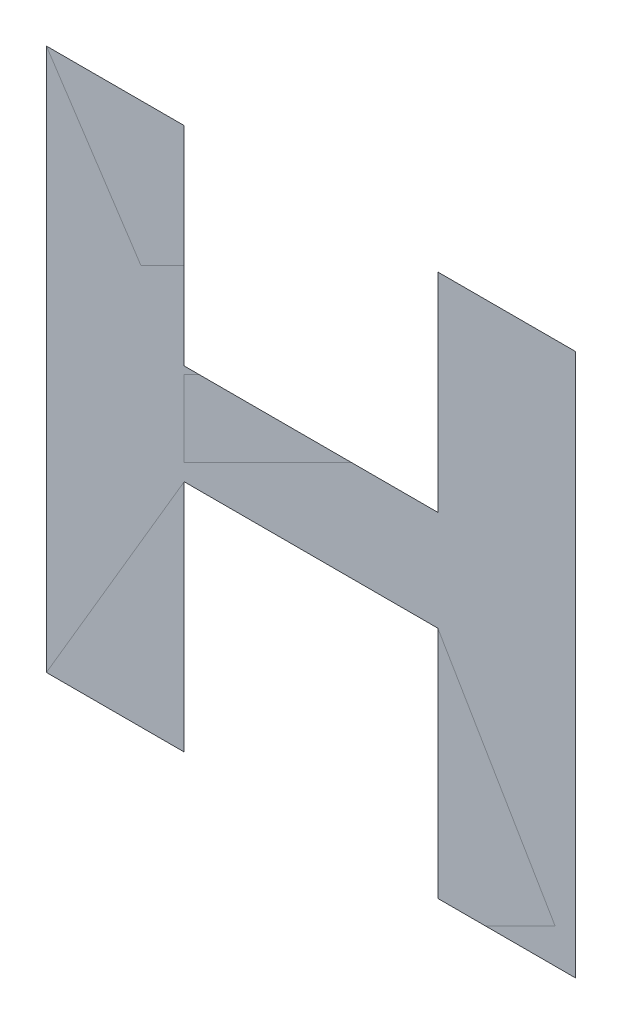
ISO-10303-21;
HEADER;
FILE_DESCRIPTION(('STEP AP214'),'2;1');
FILE_NAME('part.step','',(''),(''),'','','');
FILE_SCHEMA(('AUTOMOTIVE_DESIGN { 1 0 10303 214 1 1 1 1 }'));
ENDSEC;
DATA;
#1=APPLICATION_CONTEXT('core data for automotive mechanical design processes');
#2=APPLICATION_PROTOCOL_DEFINITION('international standard','automotive_design',2000,#1);
#3=PRODUCT_CONTEXT('',#1,'mechanical');
#4=PRODUCT('Part','Part','',(#3));
#5=PRODUCT_RELATED_PRODUCT_CATEGORY('part','',(#4));
#6=PRODUCT_DEFINITION_FORMATION('','',#4);
#7=PRODUCT_DEFINITION_CONTEXT('part definition',#1,'design');
#8=PRODUCT_DEFINITION('design','',#6,#7);
#9=PRODUCT_DEFINITION_SHAPE('','',#8);
#10=(LENGTH_UNIT() NAMED_UNIT(*) SI_UNIT(.MILLI.,.METRE.));
#11=(NAMED_UNIT(*) PLANE_ANGLE_UNIT() SI_UNIT($,.RADIAN.));
#12=(NAMED_UNIT(*) SI_UNIT($,.STERADIAN.) SOLID_ANGLE_UNIT());
#13=UNCERTAINTY_MEASURE_WITH_UNIT(LENGTH_MEASURE(1.E-05),#10,'distance_accuracy_value','');
#14=(GEOMETRIC_REPRESENTATION_CONTEXT(3) GLOBAL_UNCERTAINTY_ASSIGNED_CONTEXT((#13)) GLOBAL_UNIT_ASSIGNED_CONTEXT((#10,
#11,#12)) REPRESENTATION_CONTEXT('',''));
#15=CARTESIAN_POINT('',(0.,0.,0.));
#16=DIRECTION('',(0.,0.,1.));
#17=DIRECTION('',(1.,0.,0.));
#18=AXIS2_PLACEMENT_3D('',#15,#16,#17);
#19=CARTESIAN_POINT('',(-0.02640987644903,0.773280378382,0.00045));
#20=DIRECTION('',(0.,0.,1.));
#21=DIRECTION('',(1.,0.,0.));
#22=AXIS2_PLACEMENT_3D('',#19,#20,#21);
#23=PLANE('',#22);
#24=CARTESIAN_POINT('',(-0.00799584164895,0.821839304632,0.00045));
#25=DIRECTION('',(-1.,0.,0.));
#26=VECTOR('',#25,1.);
#27=LINE('',#24,#26);
#28=CARTESIAN_POINT('',(-0.00799584164895,0.821839304632,0.000225));
#29=VERTEX_POINT('',#28);
#30=CARTESIAN_POINT('',(-0.04483000724903,0.821839304632,0.000225));
#31=VERTEX_POINT('',#30);
#32=EDGE_CURVE('E182',#29,#31,#27,.T.);
#33=ORIENTED_EDGE('',*,*,#32,.T.);
#34=CARTESIAN_POINT('',(-0.04483000724903,0.821839304632,0.00045));
#35=DIRECTION('',(0.,1.,0.));
#36=VECTOR('',#35,1.);
#37=LINE('',#34,#36);
#38=CARTESIAN_POINT('',(-0.04483000724903,0.852070542747,0.000225));
#39=VERTEX_POINT('',#38);
#40=EDGE_CURVE('E28',#31,#39,#37,.T.);
#41=ORIENTED_EDGE('',*,*,#40,.T.);
#42=CARTESIAN_POINT('',(-0.04483000724903,0.852070542747,0.00045));
#43=DIRECTION('',(-1.,0.,0.));
#44=VECTOR('',#43,1.);
#45=LINE('',#42,#44);
#46=CARTESIAN_POINT('',(-0.064835853699,0.852070542747,0.000225));
#47=VERTEX_POINT('',#46);
#48=EDGE_CURVE('E11',#39,#47,#45,.T.);
#49=ORIENTED_EDGE('',*,*,#48,.T.);
#50=CARTESIAN_POINT('',(-0.064835853699,0.852070542747,0.00045));
#51=DIRECTION('',(0.,-1.,0.));
#52=VECTOR('',#51,1.);
#53=LINE('',#50,#52);
#54=CARTESIAN_POINT('',(-0.064835853699,0.773280378382,0.000225));
#55=VERTEX_POINT('',#54);
#56=EDGE_CURVE('E68',#47,#55,#53,.T.);
#57=ORIENTED_EDGE('',*,*,#56,.T.);
#58=CARTESIAN_POINT('',(-0.064835853699,0.773280378382,0.00045));
#59=DIRECTION('',(1.,0.,0.));
#60=VECTOR('',#59,1.);
#61=LINE('',#58,#60);
#62=CARTESIAN_POINT('',(-0.04483000724903,0.773280378382,0.000225));
#63=VERTEX_POINT('',#62);
#64=EDGE_CURVE('E65',#55,#63,#61,.T.);
#65=ORIENTED_EDGE('',*,*,#64,.T.);
#66=CARTESIAN_POINT('',(-0.04483000724903,0.773280378382,0.00045));
#67=DIRECTION('',(0.,1.,0.));
#68=VECTOR('',#67,1.);
#69=LINE('',#66,#68);
#70=CARTESIAN_POINT('',(-0.04483000724903,0.807272235722,0.000225));
#71=VERTEX_POINT('',#70);
#72=EDGE_CURVE('E170',#63,#71,#69,.T.);
#73=ORIENTED_EDGE('',*,*,#72,.T.);
#74=CARTESIAN_POINT('',(-0.04483000724903,0.807272235722,0.00045));
#75=DIRECTION('',(1.,0.,0.));
#76=VECTOR('',#75,1.);
#77=LINE('',#74,#76);
#78=CARTESIAN_POINT('',(-0.00799584164895,0.807272235722,0.000225));
#79=VERTEX_POINT('',#78);
#80=EDGE_CURVE('E171',#71,#79,#77,.T.);
#81=ORIENTED_EDGE('',*,*,#80,.T.);
#82=CARTESIAN_POINT('',(-0.00799584164895,0.807272235722,0.00045));
#83=DIRECTION('',(0.,-1.,0.));
#84=VECTOR('',#83,1.);
#85=LINE('',#82,#84);
#86=CARTESIAN_POINT('',(-0.00799584164895,0.773280378382,0.000225));
#87=VERTEX_POINT('',#86);
#88=EDGE_CURVE('E172',#79,#87,#85,.T.);
#89=ORIENTED_EDGE('',*,*,#88,.T.);
#90=CARTESIAN_POINT('',(-0.00799584164895,0.773280378382,0.00045));
#91=DIRECTION('',(1.,0.,0.));
#92=VECTOR('',#91,1.);
#93=LINE('',#90,#92);
#94=CARTESIAN_POINT('',(0.01201610080095,0.773280378382,0.000225));
#95=VERTEX_POINT('',#94);
#96=EDGE_CURVE('E174',#87,#95,#93,.T.);
#97=ORIENTED_EDGE('',*,*,#96,.T.);
#98=CARTESIAN_POINT('',(0.01201610080095,0.773280378382,0.00045));
#99=DIRECTION('',(0.,1.,0.));
#100=VECTOR('',#99,1.);
#101=LINE('',#98,#100);
#102=CARTESIAN_POINT('',(0.01201610080095,0.852070542747,0.000225));
#103=VERTEX_POINT('',#102);
#104=EDGE_CURVE('E176',#95,#103,#101,.T.);
#105=ORIENTED_EDGE('',*,*,#104,.T.);
#106=CARTESIAN_POINT('',(0.01201610080095,0.852070542747,0.00045));
#107=DIRECTION('',(-1.,0.,0.));
#108=VECTOR('',#107,1.);
#109=LINE('',#106,#108);
#110=CARTESIAN_POINT('',(-0.00799584164895,0.852070542747,0.000225));
#111=VERTEX_POINT('',#110);
#112=EDGE_CURVE('E178',#103,#111,#109,.T.);
#113=ORIENTED_EDGE('',*,*,#112,.T.);
#114=CARTESIAN_POINT('',(-0.00799584164895,0.852070542747,0.00045));
#115=DIRECTION('',(0.,-1.,0.));
#116=VECTOR('',#115,1.);
#117=LINE('',#114,#116);
#118=EDGE_CURVE('E180',#111,#29,#117,.T.);
#119=ORIENTED_EDGE('',*,*,#118,.T.);
#120=EDGE_LOOP('',(#33,#41,#49,#57,#65,#73,#81,#89,#97,#105,#113,#119));
#121=FACE_BOUND('',#120,.T.);
#122=ADVANCED_FACE('F17',(#121),#23,.T.);
#123=CARTESIAN_POINT('',(-0.02640987644903,0.773280378382,0.));
#124=DIRECTION('',(0.,0.,1.));
#125=DIRECTION('',(1.,0.,0.));
#126=AXIS2_PLACEMENT_3D('',#123,#124,#125);
#127=PLANE('',#126);
#128=ORIENTED_EDGE('',*,*,#40,.F.);
#129=ORIENTED_EDGE('',*,*,#32,.F.);
#130=ORIENTED_EDGE('',*,*,#118,.F.);
#131=ORIENTED_EDGE('',*,*,#112,.F.);
#132=ORIENTED_EDGE('',*,*,#104,.F.);
#133=ORIENTED_EDGE('',*,*,#96,.F.);
#134=ORIENTED_EDGE('',*,*,#88,.F.);
#135=ORIENTED_EDGE('',*,*,#80,.F.);
#136=ORIENTED_EDGE('',*,*,#72,.F.);
#137=ORIENTED_EDGE('',*,*,#64,.F.);
#138=ORIENTED_EDGE('',*,*,#56,.F.);
#139=ORIENTED_EDGE('',*,*,#48,.F.);
#140=EDGE_LOOP('',(#128,#129,#130,#131,#132,#133,#134,#135,#136,#137,#138,#139));
#141=FACE_BOUND('',#140,.T.);
#142=ADVANCED_FACE('F70',(#141),#127,.F.);
#143=CLOSED_SHELL('',(#122,#142));
#144=MANIFOLD_SOLID_BREP('B1',#143);
#145=ADVANCED_BREP_SHAPE_REPRESENTATION('',(#18,#144),#14);
#146=SHAPE_DEFINITION_REPRESENTATION(#9,#145);
ENDSEC;
END-ISO-10303-21;
